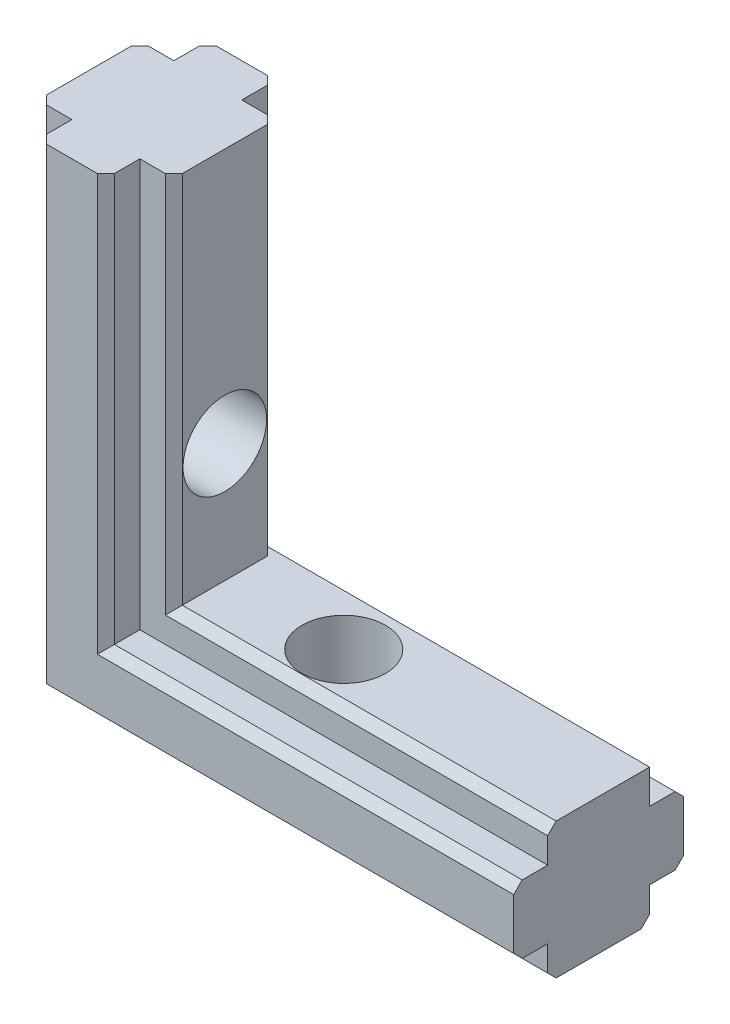
ISO-10303-21;
HEADER;
FILE_DESCRIPTION(('STEP AP214'),'2;1');
FILE_NAME('part.step','',(''),(''),'','','');
FILE_SCHEMA(('AUTOMOTIVE_DESIGN { 1 0 10303 214 1 1 1 1 }'));
ENDSEC;
DATA;
#1=APPLICATION_CONTEXT('core data for automotive mechanical design processes');
#2=APPLICATION_PROTOCOL_DEFINITION('international standard','automotive_design',2000,#1);
#3=PRODUCT_CONTEXT('',#1,'mechanical');
#4=PRODUCT('Part','Part','',(#3));
#5=PRODUCT_RELATED_PRODUCT_CATEGORY('part','',(#4));
#6=PRODUCT_DEFINITION_FORMATION('','',#4);
#7=PRODUCT_DEFINITION_CONTEXT('part definition',#1,'design');
#8=PRODUCT_DEFINITION('design','',#6,#7);
#9=PRODUCT_DEFINITION_SHAPE('','',#8);
#10=(LENGTH_UNIT() NAMED_UNIT(*) SI_UNIT(.MILLI.,.METRE.));
#11=(NAMED_UNIT(*) PLANE_ANGLE_UNIT() SI_UNIT($,.RADIAN.));
#12=(NAMED_UNIT(*) SI_UNIT($,.STERADIAN.) SOLID_ANGLE_UNIT());
#13=UNCERTAINTY_MEASURE_WITH_UNIT(LENGTH_MEASURE(1.E-05),#10,'distance_accuracy_value','');
#14=(GEOMETRIC_REPRESENTATION_CONTEXT(3) GLOBAL_UNCERTAINTY_ASSIGNED_CONTEXT((#13)) GLOBAL_UNIT_ASSIGNED_CONTEXT((#10,
#11,#12)) REPRESENTATION_CONTEXT('',''));
#15=CARTESIAN_POINT('',(0.,0.,0.));
#16=DIRECTION('',(0.,0.,1.));
#17=DIRECTION('',(1.,0.,0.));
#18=AXIS2_PLACEMENT_3D('',#15,#16,#17);
#19=CARTESIAN_POINT('',(30.,2.,0.));
#20=DIRECTION('',(0.,1.,0.));
#21=DIRECTION('',(0.,0.,1.));
#22=AXIS2_PLACEMENT_3D('',#19,#20,#21);
#23=PLANE('',#22);
#24=DIRECTION('',(0.,0.,1.));
#25=VECTOR('',#24,1.);
#26=CARTESIAN_POINT('',(30.,2.,0.));
#27=LINE('',#26,#25);
#28=CARTESIAN_POINT('',(30.,2.,2.));
#29=VERTEX_POINT('',#28);
#30=CARTESIAN_POINT('',(30.,2.,0.5));
#31=VERTEX_POINT('',#30);
#32=EDGE_CURVE('E215',#29,#31,#27,.F.);
#33=ORIENTED_EDGE('',*,*,#32,.F.);
#34=DIRECTION('',(1.,0.,0.));
#35=VECTOR('',#34,1.);
#36=CARTESIAN_POINT('',(1.,2.,2.));
#37=LINE('',#36,#35);
#38=CARTESIAN_POINT('',(2.,2.,2.));
#39=VERTEX_POINT('',#38);
#40=EDGE_CURVE('E209',#29,#39,#37,.F.);
#41=ORIENTED_EDGE('',*,*,#40,.T.);
#42=DIRECTION('',(0.,0.,-1.));
#43=VECTOR('',#42,1.);
#44=CARTESIAN_POINT('',(2.,2.,0.));
#45=LINE('',#44,#43);
#46=CARTESIAN_POINT('',(2.,2.,0.5));
#47=VERTEX_POINT('',#46);
#48=EDGE_CURVE('E222',#39,#47,#45,.T.);
#49=ORIENTED_EDGE('',*,*,#48,.T.);
#50=DIRECTION('',(1.,0.,0.));
#51=VECTOR('',#50,1.);
#52=CARTESIAN_POINT('',(17.,2.,0.5));
#53=LINE('',#52,#51);
#54=EDGE_CURVE('E225',#31,#47,#53,.F.);
#55=ORIENTED_EDGE('',*,*,#54,.F.);
#56=EDGE_LOOP('',(#33,#41,#49,#55));
#57=FACE_BOUND('',#56,.T.);
#58=ADVANCED_FACE('F17',(#57),#23,.F.);
#59=CARTESIAN_POINT('',(2.,2.,0.));
#60=DIRECTION('',(1.,0.,0.));
#61=DIRECTION('',(0.,0.,-1.));
#62=AXIS2_PLACEMENT_3D('',#59,#60,#61);
#63=PLANE('',#62);
#64=ORIENTED_EDGE('',*,*,#48,.F.);
#65=DIRECTION('',(0.,1.,0.));
#66=VECTOR('',#65,1.);
#67=CARTESIAN_POINT('',(2.,16.,2.));
#68=LINE('',#67,#66);
#69=CARTESIAN_POINT('',(2.,30.,2.));
#70=VERTEX_POINT('',#69);
#71=EDGE_CURVE('E234',#39,#70,#68,.T.);
#72=ORIENTED_EDGE('',*,*,#71,.T.);
#73=DIRECTION('',(0.,0.,-1.));
#74=VECTOR('',#73,1.);
#75=CARTESIAN_POINT('',(2.,30.,0.));
#76=LINE('',#75,#74);
#77=CARTESIAN_POINT('',(2.,30.,0.5));
#78=VERTEX_POINT('',#77);
#79=EDGE_CURVE('E228',#78,#70,#76,.F.);
#80=ORIENTED_EDGE('',*,*,#79,.F.);
#81=DIRECTION('',(0.,1.,0.));
#82=VECTOR('',#81,1.);
#83=CARTESIAN_POINT('',(2.,10.5,0.5));
#84=LINE('',#83,#82);
#85=EDGE_CURVE('E376',#47,#78,#84,.T.);
#86=ORIENTED_EDGE('',*,*,#85,.F.);
#87=EDGE_LOOP('',(#64,#72,#80,#86));
#88=FACE_BOUND('',#87,.T.);
#89=ADVANCED_FACE('F987',(#88),#63,.F.);
#90=CARTESIAN_POINT('',(1.,16.,2.));
#91=DIRECTION('',(0.,0.,1.));
#92=DIRECTION('',(1.,0.,0.));
#93=AXIS2_PLACEMENT_3D('',#90,#91,#92);
#94=PLANE('',#93);
#95=DIRECTION('',(1.,0.,0.));
#96=VECTOR('',#95,1.);
#97=CARTESIAN_POINT('',(1.,30.,2.));
#98=LINE('',#97,#96);
#99=CARTESIAN_POINT('',(0.5,30.,2.));
#100=VERTEX_POINT('',#99);
#101=EDGE_CURVE('E240',#70,#100,#98,.F.);
#102=ORIENTED_EDGE('',*,*,#101,.F.);
#103=ORIENTED_EDGE('',*,*,#71,.F.);
#104=ORIENTED_EDGE('',*,*,#40,.F.);
#105=DIRECTION('',(0.,1.,0.));
#106=VECTOR('',#105,1.);
#107=CARTESIAN_POINT('',(30.,16.,2.));
#108=LINE('',#107,#106);
#109=CARTESIAN_POINT('',(30.,0.5,2.));
#110=VERTEX_POINT('',#109);
#111=EDGE_CURVE('E213',#110,#29,#108,.T.);
#112=ORIENTED_EDGE('',*,*,#111,.F.);
#113=DIRECTION('',(1.,0.,0.));
#114=VECTOR('',#113,1.);
#115=CARTESIAN_POINT('',(0.5,0.5,2.));
#116=LINE('',#115,#114);
#117=CARTESIAN_POINT('',(0.5,0.499999999999999,2.));
#118=VERTEX_POINT('',#117);
#119=EDGE_CURVE('E336',#118,#110,#116,.T.);
#120=ORIENTED_EDGE('',*,*,#119,.F.);
#121=DIRECTION('',(0.,1.,0.));
#122=VECTOR('',#121,1.);
#123=CARTESIAN_POINT('',(0.5,23.,2.));
#124=LINE('',#123,#122);
#125=EDGE_CURVE('E412',#100,#118,#124,.F.);
#126=ORIENTED_EDGE('',*,*,#125,.F.);
#127=EDGE_LOOP('',(#102,#103,#104,#112,#120,#126));
#128=FACE_BOUND('',#127,.T.);
#129=ADVANCED_FACE('F232',(#128),#94,.F.);
#130=CARTESIAN_POINT('',(0.25,23.,2.25));
#131=DIRECTION('',(-0.707106781186547,0.,-0.707106781186548));
#132=DIRECTION('',(-0.707106781186548,0.,0.707106781186547));
#133=AXIS2_PLACEMENT_3D('',#130,#131,#132);
#134=PLANE('',#133);
#135=ORIENTED_EDGE('',*,*,#125,.T.);
#136=DIRECTION('',(0.577350269189626,0.577350269189626,-0.577350269189625));
#137=VECTOR('',#136,1.);
#138=CARTESIAN_POINT('',(0.,0.,2.5));
#139=LINE('',#138,#137);
#140=CARTESIAN_POINT('',(0.,0.,2.5));
#141=VERTEX_POINT('',#140);
#142=EDGE_CURVE('E331',#141,#118,#139,.T.);
#143=ORIENTED_EDGE('',*,*,#142,.F.);
#144=DIRECTION('',(0.,1.,0.));
#145=VECTOR('',#144,1.);
#146=CARTESIAN_POINT('',(0.,30.,2.5));
#147=LINE('',#146,#145);
#148=CARTESIAN_POINT('',(0.,30.,2.5));
#149=VERTEX_POINT('',#148);
#150=EDGE_CURVE('E285',#149,#141,#147,.F.);
#151=ORIENTED_EDGE('',*,*,#150,.F.);
#152=DIRECTION('',(-0.707106781186548,0.,0.707106781186547));
#153=VECTOR('',#152,1.);
#154=CARTESIAN_POINT('',(0.25,30.,2.25));
#155=LINE('',#154,#153);
#156=EDGE_CURVE('E416',#149,#100,#155,.F.);
#157=ORIENTED_EDGE('',*,*,#156,.T.);
#158=EDGE_LOOP('',(#135,#143,#151,#157));
#159=FACE_BOUND('',#158,.T.);
#160=ADVANCED_FACE('F427',(#159),#134,.T.);
#161=CARTESIAN_POINT('',(0.25,19.2333333333333,7.75));
#162=DIRECTION('',(-0.707106781186548,0.,0.707106781186548));
#163=DIRECTION('',(0.707106781186548,0.,0.707106781186548));
#164=AXIS2_PLACEMENT_3D('',#161,#162,#163);
#165=PLANE('',#164);
#166=DIRECTION('',(0.,1.,0.));
#167=VECTOR('',#166,1.);
#168=CARTESIAN_POINT('',(0.,30.,7.5));
#169=LINE('',#168,#167);
#170=CARTESIAN_POINT('',(0.,0.,7.5));
#171=VERTEX_POINT('',#170);
#172=CARTESIAN_POINT('',(0.,30.,7.5));
#173=VERTEX_POINT('',#172);
#174=EDGE_CURVE('E275',#171,#173,#169,.T.);
#175=ORIENTED_EDGE('',*,*,#174,.F.);
#176=DIRECTION('',(-0.577350269189625,-0.577350269189626,-0.577350269189626));
#177=VECTOR('',#176,1.);
#178=CARTESIAN_POINT('',(0.499999999999998,0.5,8.));
#179=LINE('',#178,#177);
#180=CARTESIAN_POINT('',(0.499999999999999,0.499999999999997,8.));
#181=VERTEX_POINT('',#180);
#182=EDGE_CURVE('E319',#181,#171,#179,.T.);
#183=ORIENTED_EDGE('',*,*,#182,.F.);
#184=DIRECTION('',(0.,1.,0.));
#185=VECTOR('',#184,1.);
#186=CARTESIAN_POINT('',(0.5,8.46666666666667,8.));
#187=LINE('',#186,#185);
#188=CARTESIAN_POINT('',(0.5,30.,8.));
#189=VERTEX_POINT('',#188);
#190=EDGE_CURVE('E395',#189,#181,#187,.F.);
#191=ORIENTED_EDGE('',*,*,#190,.F.);
#192=DIRECTION('',(0.707106781186548,0.,0.707106781186548));
#193=VECTOR('',#192,1.);
#194=CARTESIAN_POINT('',(0.25,30.,7.75));
#195=LINE('',#194,#193);
#196=EDGE_CURVE('E409',#189,#173,#195,.F.);
#197=ORIENTED_EDGE('',*,*,#196,.T.);
#198=EDGE_LOOP('',(#175,#183,#191,#197));
#199=FACE_BOUND('',#198,.T.);
#200=ADVANCED_FACE('F627',(#199),#165,.T.);
#201=CARTESIAN_POINT('',(7.75,10.4791666666667,7.75));
#202=DIRECTION('',(0.707106781186548,0.,0.707106781186548));
#203=DIRECTION('',(0.707106781186548,0.,-0.707106781186548));
#204=AXIS2_PLACEMENT_3D('',#201,#202,#203);
#205=PLANE('',#204);
#206=DIRECTION('',(0.,1.,0.));
#207=VECTOR('',#206,1.);
#208=CARTESIAN_POINT('',(7.5,12.9583333333333,8.));
#209=LINE('',#208,#207);
#210=CARTESIAN_POINT('',(7.5,7.5,8.));
#211=VERTEX_POINT('',#210);
#212=CARTESIAN_POINT('',(7.5,30.,8.));
#213=VERTEX_POINT('',#212);
#214=EDGE_CURVE('E315',#211,#213,#209,.T.);
#215=ORIENTED_EDGE('',*,*,#214,.F.);
#216=DIRECTION('',(-0.577350269189626,-0.577350269189626,0.577350269189626));
#217=VECTOR('',#216,1.);
#218=CARTESIAN_POINT('',(8.,8.,7.5));
#219=LINE('',#218,#217);
#220=CARTESIAN_POINT('',(8.,8.,7.5));
#221=VERTEX_POINT('',#220);
#222=EDGE_CURVE('E338',#221,#211,#219,.T.);
#223=ORIENTED_EDGE('',*,*,#222,.F.);
#224=DIRECTION('',(0.,1.,0.));
#225=VECTOR('',#224,1.);
#226=CARTESIAN_POINT('',(8.,8.,7.5));
#227=LINE('',#226,#225);
#228=CARTESIAN_POINT('',(8.,30.,7.5));
#229=VERTEX_POINT('',#228);
#230=EDGE_CURVE('E269',#229,#221,#227,.F.);
#231=ORIENTED_EDGE('',*,*,#230,.F.);
#232=DIRECTION('',(0.707106781186548,0.,-0.707106781186548));
#233=VECTOR('',#232,1.);
#234=CARTESIAN_POINT('',(7.75,30.,7.75));
#235=LINE('',#234,#233);
#236=EDGE_CURVE('E406',#229,#213,#235,.F.);
#237=ORIENTED_EDGE('',*,*,#236,.T.);
#238=EDGE_LOOP('',(#215,#223,#231,#237));
#239=FACE_BOUND('',#238,.T.);
#240=ADVANCED_FACE('F953',(#239),#205,.T.);
#241=CARTESIAN_POINT('',(43.5889894354067,15.,5.));
#242=DIRECTION('',(-1.,0.,0.));
#243=DIRECTION('',(0.,0.,1.));
#244=AXIS2_PLACEMENT_3D('',#241,#242,#243);
#245=CYLINDRICAL_SURFACE('',#244,2.4585);
#246=CARTESIAN_POINT('',(0.,15.,5.));
#247=DIRECTION('',(-1.,0.,0.));
#248=DIRECTION('',(0.,0.,1.));
#249=AXIS2_PLACEMENT_3D('',#246,#247,#248);
#250=CIRCLE('',#249,2.4585);
#251=CARTESIAN_POINT('',(0.,15.,7.4585));
#252=VERTEX_POINT('',#251);
#253=EDGE_CURVE('E271',#252,#252,#250,.F.);
#254=ORIENTED_EDGE('',*,*,#253,.F.);
#255=EDGE_LOOP('',(#254));
#256=FACE_BOUND('',#255,.T.);
#257=CARTESIAN_POINT('',(8.,15.,5.));
#258=DIRECTION('',(-1.,0.,0.));
#259=DIRECTION('',(0.,0.,1.));
#260=AXIS2_PLACEMENT_3D('',#257,#258,#259);
#261=CIRCLE('',#260,2.4585);
#262=CARTESIAN_POINT('',(8.,15.,7.4585));
#263=VERTEX_POINT('',#262);
#264=EDGE_CURVE('E264',#263,#263,#261,.T.);
#265=ORIENTED_EDGE('',*,*,#264,.F.);
#266=EDGE_LOOP('',(#265));
#267=FACE_BOUND('',#266,.T.);
#268=ADVANCED_FACE('F944',(#256,#267),#245,.F.);
#269=CARTESIAN_POINT('',(8.46666666666667,8.46666666666667,8.));
#270=DIRECTION('',(0.,0.,1.));
#271=DIRECTION('',(1.,0.,0.));
#272=AXIS2_PLACEMENT_3D('',#269,#270,#271);
#273=PLANE('',#272);
#274=DIRECTION('',(1.,0.,0.));
#275=VECTOR('',#274,1.);
#276=CARTESIAN_POINT('',(8.46666666666667,30.,8.));
#277=LINE('',#276,#275);
#278=CARTESIAN_POINT('',(2.,30.,8.));
#279=VERTEX_POINT('',#278);
#280=EDGE_CURVE('E398',#279,#189,#277,.F.);
#281=ORIENTED_EDGE('',*,*,#280,.T.);
#282=ORIENTED_EDGE('',*,*,#190,.T.);
#283=DIRECTION('',(1.,0.,0.));
#284=VECTOR('',#283,1.);
#285=CARTESIAN_POINT('',(4.23333333333333,0.5,8.));
#286=LINE('',#285,#284);
#287=CARTESIAN_POINT('',(30.,0.5,8.));
#288=VERTEX_POINT('',#287);
#289=EDGE_CURVE('E323',#288,#181,#286,.F.);
#290=ORIENTED_EDGE('',*,*,#289,.F.);
#291=DIRECTION('',(0.,1.,0.));
#292=VECTOR('',#291,1.);
#293=CARTESIAN_POINT('',(30.,8.46666666666667,8.));
#294=LINE('',#293,#292);
#295=CARTESIAN_POINT('',(30.,2.,8.));
#296=VERTEX_POINT('',#295);
#297=EDGE_CURVE('E402',#288,#296,#294,.T.);
#298=ORIENTED_EDGE('',*,*,#297,.T.);
#299=DIRECTION('',(1.,0.,0.));
#300=VECTOR('',#299,1.);
#301=CARTESIAN_POINT('',(2.,2.,8.));
#302=LINE('',#301,#300);
#303=CARTESIAN_POINT('',(2.,2.,8.));
#304=VERTEX_POINT('',#303);
#305=EDGE_CURVE('E500',#296,#304,#302,.F.);
#306=ORIENTED_EDGE('',*,*,#305,.T.);
#307=DIRECTION('',(0.,1.,0.));
#308=VECTOR('',#307,1.);
#309=CARTESIAN_POINT('',(2.,30.,8.));
#310=LINE('',#309,#308);
#311=EDGE_CURVE('E268',#304,#279,#310,.T.);
#312=ORIENTED_EDGE('',*,*,#311,.T.);
#313=EDGE_LOOP('',(#281,#282,#290,#298,#306,#312));
#314=FACE_BOUND('',#313,.T.);
#315=ADVANCED_FACE('F616',(#314),#273,.T.);
#316=CARTESIAN_POINT('',(17.,2.25,0.25));
#317=DIRECTION('',(0.,-0.707106781186548,-0.707106781186547));
#318=DIRECTION('',(0.,0.707106781186547,-0.707106781186548));
#319=AXIS2_PLACEMENT_3D('',#316,#317,#318);
#320=PLANE('',#319);
#321=ORIENTED_EDGE('',*,*,#54,.T.);
#322=DIRECTION('',(-0.577350269189625,-0.577350269189626,0.577350269189626));
#323=VECTOR('',#322,1.);
#324=CARTESIAN_POINT('',(2.5,2.5,0.));
#325=LINE('',#324,#323);
#326=CARTESIAN_POINT('',(2.5,2.5,0.));
#327=VERTEX_POINT('',#326);
#328=EDGE_CURVE('E369',#327,#47,#325,.T.);
#329=ORIENTED_EDGE('',*,*,#328,.F.);
#330=DIRECTION('',(1.,0.,0.));
#331=VECTOR('',#330,1.);
#332=CARTESIAN_POINT('',(4.,2.5,0.));
#333=LINE('',#332,#331);
#334=CARTESIAN_POINT('',(30.,2.5,0.));
#335=VERTEX_POINT('',#334);
#336=EDGE_CURVE('E493',#327,#335,#333,.T.);
#337=ORIENTED_EDGE('',*,*,#336,.T.);
#338=DIRECTION('',(0.,0.707106781186547,-0.707106781186548));
#339=VECTOR('',#338,1.);
#340=CARTESIAN_POINT('',(30.,2.25,0.25));
#341=LINE('',#340,#339);
#342=EDGE_CURVE('E392',#335,#31,#341,.F.);
#343=ORIENTED_EDGE('',*,*,#342,.T.);
#344=EDGE_LOOP('',(#321,#329,#337,#343));
#345=FACE_BOUND('',#344,.T.);
#346=ADVANCED_FACE('F925',(#345),#320,.T.);
#347=CARTESIAN_POINT('',(6.,5.75,0.25));
#348=DIRECTION('',(0.,0.707106781186547,-0.707106781186548));
#349=DIRECTION('',(0.,0.707106781186548,0.707106781186547));
#350=AXIS2_PLACEMENT_3D('',#347,#348,#349);
#351=PLANE('',#350);
#352=DIRECTION('',(1.,0.,0.));
#353=VECTOR('',#352,1.);
#354=CARTESIAN_POINT('',(4.,5.5,0.));
#355=LINE('',#354,#353);
#356=CARTESIAN_POINT('',(30.,5.5,0.));
#357=VERTEX_POINT('',#356);
#358=CARTESIAN_POINT('',(5.5,5.5,0.));
#359=VERTEX_POINT('',#358);
#360=EDGE_CURVE('E490',#357,#359,#355,.F.);
#361=ORIENTED_EDGE('',*,*,#360,.T.);
#362=DIRECTION('',(-0.577350269189626,-0.577350269189626,-0.577350269189625));
#363=VECTOR('',#362,1.);
#364=CARTESIAN_POINT('',(6.,6.,0.5));
#365=LINE('',#364,#363);
#366=CARTESIAN_POINT('',(6.,5.99999999999999,0.499999999999999));
#367=VERTEX_POINT('',#366);
#368=EDGE_CURVE('E380',#367,#359,#365,.T.);
#369=ORIENTED_EDGE('',*,*,#368,.F.);
#370=DIRECTION('',(1.,0.,0.));
#371=VECTOR('',#370,1.);
#372=CARTESIAN_POINT('',(8.,6.,0.5));
#373=LINE('',#372,#371);
#374=CARTESIAN_POINT('',(30.,6.,0.5));
#375=VERTEX_POINT('',#374);
#376=EDGE_CURVE('E351',#367,#375,#373,.T.);
#377=ORIENTED_EDGE('',*,*,#376,.T.);
#378=DIRECTION('',(0.,0.707106781186548,0.707106781186547));
#379=VECTOR('',#378,1.);
#380=CARTESIAN_POINT('',(30.,5.75,0.25));
#381=LINE('',#380,#379);
#382=EDGE_CURVE('E388',#375,#357,#381,.F.);
#383=ORIENTED_EDGE('',*,*,#382,.T.);
#384=EDGE_LOOP('',(#361,#369,#377,#383));
#385=FACE_BOUND('',#384,.T.);
#386=ADVANCED_FACE('F915',(#385),#351,.T.);
#387=CARTESIAN_POINT('',(5.75,24.5,0.25));
#388=DIRECTION('',(0.707106781186547,0.,-0.707106781186548));
#389=DIRECTION('',(-0.707106781186548,0.,-0.707106781186547));
#390=AXIS2_PLACEMENT_3D('',#387,#388,#389);
#391=PLANE('',#390);
#392=DIRECTION('',(0.,1.,0.));
#393=VECTOR('',#392,1.);
#394=CARTESIAN_POINT('',(6.,30.,0.5));
#395=LINE('',#394,#393);
#396=CARTESIAN_POINT('',(6.,30.,0.5));
#397=VERTEX_POINT('',#396);
#398=EDGE_CURVE('E362',#397,#367,#395,.F.);
#399=ORIENTED_EDGE('',*,*,#398,.T.);
#400=ORIENTED_EDGE('',*,*,#368,.T.);
#401=DIRECTION('',(0.,1.,0.));
#402=VECTOR('',#401,1.);
#403=CARTESIAN_POINT('',(5.5,19.,0.));
#404=LINE('',#403,#402);
#405=CARTESIAN_POINT('',(5.5,30.,0.));
#406=VERTEX_POINT('',#405);
#407=EDGE_CURVE('E486',#359,#406,#404,.T.);
#408=ORIENTED_EDGE('',*,*,#407,.T.);
#409=DIRECTION('',(-0.707106781186548,0.,-0.707106781186547));
#410=VECTOR('',#409,1.);
#411=CARTESIAN_POINT('',(5.75,30.,0.25));
#412=LINE('',#411,#410);
#413=EDGE_CURVE('E384',#406,#397,#412,.F.);
#414=ORIENTED_EDGE('',*,*,#413,.T.);
#415=EDGE_LOOP('',(#399,#400,#408,#414));
#416=FACE_BOUND('',#415,.T.);
#417=ADVANCED_FACE('F905',(#416),#391,.T.);
#418=CARTESIAN_POINT('',(2.25,10.5,0.25));
#419=DIRECTION('',(-0.707106781186548,0.,-0.707106781186547));
#420=DIRECTION('',(-0.707106781186547,0.,0.707106781186548));
#421=AXIS2_PLACEMENT_3D('',#418,#419,#420);
#422=PLANE('',#421);
#423=DIRECTION('',(0.,1.,0.));
#424=VECTOR('',#423,1.);
#425=CARTESIAN_POINT('',(2.5,19.,0.));
#426=LINE('',#425,#424);
#427=CARTESIAN_POINT('',(2.5,30.,0.));
#428=VERTEX_POINT('',#427);
#429=EDGE_CURVE('E482',#428,#327,#426,.F.);
#430=ORIENTED_EDGE('',*,*,#429,.T.);
#431=ORIENTED_EDGE('',*,*,#328,.T.);
#432=ORIENTED_EDGE('',*,*,#85,.T.);
#433=DIRECTION('',(-0.707106781186547,0.,0.707106781186548));
#434=VECTOR('',#433,1.);
#435=CARTESIAN_POINT('',(2.25,30.,0.25));
#436=LINE('',#435,#434);
#437=EDGE_CURVE('E373',#78,#428,#436,.F.);
#438=ORIENTED_EDGE('',*,*,#437,.T.);
#439=EDGE_LOOP('',(#430,#431,#432,#438));
#440=FACE_BOUND('',#439,.T.);
#441=ADVANCED_FACE('F895',(#440),#422,.T.);
#442=CARTESIAN_POINT('',(6.,30.,0.));
#443=DIRECTION('',(-1.,0.,0.));
#444=DIRECTION('',(0.,0.,1.));
#445=AXIS2_PLACEMENT_3D('',#442,#443,#444);
#446=PLANE('',#445);
#447=DIRECTION('',(0.,0.,1.));
#448=VECTOR('',#447,1.);
#449=CARTESIAN_POINT('',(6.,30.,0.));
#450=LINE('',#449,#448);
#451=CARTESIAN_POINT('',(6.,30.,2.));
#452=VERTEX_POINT('',#451);
#453=EDGE_CURVE('E366',#452,#397,#450,.F.);
#454=ORIENTED_EDGE('',*,*,#453,.F.);
#455=DIRECTION('',(0.,1.,0.));
#456=VECTOR('',#455,1.);
#457=CARTESIAN_POINT('',(6.,7.,2.));
#458=LINE('',#457,#456);
#459=CARTESIAN_POINT('',(6.,6.,2.));
#460=VERTEX_POINT('',#459);
#461=EDGE_CURVE('E479',#452,#460,#458,.F.);
#462=ORIENTED_EDGE('',*,*,#461,.T.);
#463=DIRECTION('',(0.,0.,-1.));
#464=VECTOR('',#463,1.);
#465=CARTESIAN_POINT('',(6.,6.,0.));
#466=LINE('',#465,#464);
#467=EDGE_CURVE('E355',#460,#367,#466,.T.);
#468=ORIENTED_EDGE('',*,*,#467,.T.);
#469=ORIENTED_EDGE('',*,*,#398,.F.);
#470=EDGE_LOOP('',(#454,#462,#468,#469));
#471=FACE_BOUND('',#470,.T.);
#472=ADVANCED_FACE('F885',(#471),#446,.F.);
#473=CARTESIAN_POINT('',(8.,6.,0.));
#474=DIRECTION('',(0.,-1.,0.));
#475=DIRECTION('',(0.,0.,-1.));
#476=AXIS2_PLACEMENT_3D('',#473,#474,#475);
#477=PLANE('',#476);
#478=ORIENTED_EDGE('',*,*,#467,.F.);
#479=DIRECTION('',(1.,0.,0.));
#480=VECTOR('',#479,1.);
#481=CARTESIAN_POINT('',(19.,6.,2.));
#482=LINE('',#481,#480);
#483=CARTESIAN_POINT('',(30.,6.,2.));
#484=VERTEX_POINT('',#483);
#485=EDGE_CURVE('E475',#460,#484,#482,.T.);
#486=ORIENTED_EDGE('',*,*,#485,.T.);
#487=DIRECTION('',(0.,0.,-1.));
#488=VECTOR('',#487,1.);
#489=CARTESIAN_POINT('',(30.,6.,0.));
#490=LINE('',#489,#488);
#491=EDGE_CURVE('E359',#375,#484,#490,.F.);
#492=ORIENTED_EDGE('',*,*,#491,.F.);
#493=ORIENTED_EDGE('',*,*,#376,.F.);
#494=EDGE_LOOP('',(#478,#486,#492,#493));
#495=FACE_BOUND('',#494,.T.);
#496=ADVANCED_FACE('F876',(#495),#477,.F.);
#497=CARTESIAN_POINT('',(7.75,7.5,2.25));
#498=DIRECTION('',(0.707106781186547,0.,-0.707106781186548));
#499=DIRECTION('',(-0.707106781186548,0.,-0.707106781186547));
#500=AXIS2_PLACEMENT_3D('',#497,#498,#499);
#501=PLANE('',#500);
#502=DIRECTION('',(-0.707106781186548,0.,-0.707106781186547));
#503=VECTOR('',#502,1.);
#504=CARTESIAN_POINT('',(7.75,8.,2.25));
#505=LINE('',#504,#503);
#506=CARTESIAN_POINT('',(8.,8.,2.5));
#507=VERTEX_POINT('',#506);
#508=CARTESIAN_POINT('',(7.5,8.,2.));
#509=VERTEX_POINT('',#508);
#510=EDGE_CURVE('E345',#507,#509,#505,.T.);
#511=ORIENTED_EDGE('',*,*,#510,.T.);
#512=DIRECTION('',(0.,1.,0.));
#513=VECTOR('',#512,1.);
#514=CARTESIAN_POINT('',(7.5,7.,2.));
#515=LINE('',#514,#513);
#516=CARTESIAN_POINT('',(7.5,30.,2.));
#517=VERTEX_POINT('',#516);
#518=EDGE_CURVE('E471',#509,#517,#515,.T.);
#519=ORIENTED_EDGE('',*,*,#518,.T.);
#520=DIRECTION('',(-0.707106781186548,0.,-0.707106781186547));
#521=VECTOR('',#520,1.);
#522=CARTESIAN_POINT('',(7.75,30.,2.25));
#523=LINE('',#522,#521);
#524=CARTESIAN_POINT('',(8.,30.,2.5));
#525=VERTEX_POINT('',#524);
#526=EDGE_CURVE('E348',#517,#525,#523,.F.);
#527=ORIENTED_EDGE('',*,*,#526,.T.);
#528=DIRECTION('',(0.,1.,0.));
#529=VECTOR('',#528,1.);
#530=CARTESIAN_POINT('',(8.,8.,2.5));
#531=LINE('',#530,#529);
#532=EDGE_CURVE('E274',#507,#525,#531,.T.);
#533=ORIENTED_EDGE('',*,*,#532,.F.);
#534=EDGE_LOOP('',(#511,#519,#527,#533));
#535=FACE_BOUND('',#534,.T.);
#536=ADVANCED_FACE('F526',(#535),#501,.T.);
#537=CARTESIAN_POINT('',(21.4791666666667,7.75,7.75));
#538=DIRECTION('',(0.,0.707106781186548,0.707106781186547));
#539=DIRECTION('',(0.,-0.707106781186547,0.707106781186548));
#540=AXIS2_PLACEMENT_3D('',#537,#538,#539);
#541=PLANE('',#540);
#542=DIRECTION('',(1.,0.,0.));
#543=VECTOR('',#542,1.);
#544=CARTESIAN_POINT('',(30.,8.,7.5));
#545=LINE('',#544,#543);
#546=CARTESIAN_POINT('',(30.,8.,7.5));
#547=VERTEX_POINT('',#546);
#548=EDGE_CURVE('E467',#221,#547,#545,.T.);
#549=ORIENTED_EDGE('',*,*,#548,.F.);
#550=ORIENTED_EDGE('',*,*,#222,.T.);
#551=DIRECTION('',(1.,0.,0.));
#552=VECTOR('',#551,1.);
#553=CARTESIAN_POINT('',(12.9583333333333,7.5,8.));
#554=LINE('',#553,#552);
#555=CARTESIAN_POINT('',(30.,7.5,8.));
#556=VERTEX_POINT('',#555);
#557=EDGE_CURVE('E303',#556,#211,#554,.F.);
#558=ORIENTED_EDGE('',*,*,#557,.F.);
#559=DIRECTION('',(0.,-0.707106781186547,0.707106781186548));
#560=VECTOR('',#559,1.);
#561=CARTESIAN_POINT('',(30.,7.75,7.75));
#562=LINE('',#561,#560);
#563=EDGE_CURVE('E342',#556,#547,#562,.F.);
#564=ORIENTED_EDGE('',*,*,#563,.T.);
#565=EDGE_LOOP('',(#549,#550,#558,#564));
#566=FACE_BOUND('',#565,.T.);
#567=ADVANCED_FACE('F637',(#566),#541,.T.);
#568=CARTESIAN_POINT('',(0.5,0.25,2.25));
#569=DIRECTION('',(0.,-0.707106781186547,-0.707106781186548));
#570=DIRECTION('',(0.,0.707106781186548,-0.707106781186547));
#571=AXIS2_PLACEMENT_3D('',#568,#569,#570);
#572=PLANE('',#571);
#573=DIRECTION('',(1.,0.,0.));
#574=VECTOR('',#573,1.);
#575=CARTESIAN_POINT('',(0.,0.,2.5));
#576=LINE('',#575,#574);
#577=CARTESIAN_POINT('',(30.,0.,2.5));
#578=VERTEX_POINT('',#577);
#579=EDGE_CURVE('E260',#141,#578,#576,.T.);
#580=ORIENTED_EDGE('',*,*,#579,.F.);
#581=ORIENTED_EDGE('',*,*,#142,.T.);
#582=ORIENTED_EDGE('',*,*,#119,.T.);
#583=DIRECTION('',(0.,0.707106781186548,-0.707106781186547));
#584=VECTOR('',#583,1.);
#585=CARTESIAN_POINT('',(30.,0.25,2.25));
#586=LINE('',#585,#584);
#587=EDGE_CURVE('E218',#110,#578,#586,.F.);
#588=ORIENTED_EDGE('',*,*,#587,.T.);
#589=EDGE_LOOP('',(#580,#581,#582,#588));
#590=FACE_BOUND('',#589,.T.);
#591=ADVANCED_FACE('F635',(#590),#572,.T.);
#592=CARTESIAN_POINT('',(4.23333333333333,0.25,7.75));
#593=DIRECTION('',(0.,-0.707106781186548,0.707106781186548));
#594=DIRECTION('',(0.,-0.707106781186548,-0.707106781186548));
#595=AXIS2_PLACEMENT_3D('',#592,#593,#594);
#596=PLANE('',#595);
#597=ORIENTED_EDGE('',*,*,#289,.T.);
#598=ORIENTED_EDGE('',*,*,#182,.T.);
#599=DIRECTION('',(1.,0.,0.));
#600=VECTOR('',#599,1.);
#601=CARTESIAN_POINT('',(0.,0.,7.5));
#602=LINE('',#601,#600);
#603=CARTESIAN_POINT('',(30.,0.,7.5));
#604=VERTEX_POINT('',#603);
#605=EDGE_CURVE('E454',#604,#171,#602,.F.);
#606=ORIENTED_EDGE('',*,*,#605,.F.);
#607=DIRECTION('',(0.,-0.707106781186548,-0.707106781186548));
#608=VECTOR('',#607,1.);
#609=CARTESIAN_POINT('',(30.,0.25,7.75));
#610=LINE('',#609,#608);
#611=EDGE_CURVE('E327',#604,#288,#610,.F.);
#612=ORIENTED_EDGE('',*,*,#611,.T.);
#613=EDGE_LOOP('',(#597,#598,#606,#612));
#614=FACE_BOUND('',#613,.T.);
#615=ADVANCED_FACE('F630',(#614),#596,.T.);
#616=CARTESIAN_POINT('',(15.,43.5889894354067,5.));
#617=DIRECTION('',(0.,-1.,0.));
#618=DIRECTION('',(0.,0.,-1.));
#619=AXIS2_PLACEMENT_3D('',#616,#617,#618);
#620=CYLINDRICAL_SURFACE('',#619,2.4585);
#621=CARTESIAN_POINT('',(15.,0.,5.));
#622=DIRECTION('',(0.,-1.,0.));
#623=DIRECTION('',(0.,0.,-1.));
#624=AXIS2_PLACEMENT_3D('',#621,#622,#623);
#625=CIRCLE('',#624,2.4585);
#626=CARTESIAN_POINT('',(15.,0.,2.5415));
#627=VERTEX_POINT('',#626);
#628=EDGE_CURVE('E248',#627,#627,#625,.F.);
#629=ORIENTED_EDGE('',*,*,#628,.F.);
#630=EDGE_LOOP('',(#629));
#631=FACE_BOUND('',#630,.T.);
#632=CARTESIAN_POINT('',(15.,8.,5.));
#633=DIRECTION('',(0.,-1.,0.));
#634=DIRECTION('',(0.,0.,-1.));
#635=AXIS2_PLACEMENT_3D('',#632,#633,#634);
#636=CIRCLE('',#635,2.4585);
#637=CARTESIAN_POINT('',(15.,8.,2.5415));
#638=VERTEX_POINT('',#637);
#639=EDGE_CURVE('E256',#638,#638,#636,.T.);
#640=ORIENTED_EDGE('',*,*,#639,.F.);
#641=EDGE_LOOP('',(#640));
#642=FACE_BOUND('',#641,.T.);
#643=ADVANCED_FACE('F644',(#631,#642),#620,.F.);
#644=CARTESIAN_POINT('',(12.9583333333333,12.9583333333333,8.));
#645=DIRECTION('',(0.,0.,1.));
#646=DIRECTION('',(1.,0.,0.));
#647=AXIS2_PLACEMENT_3D('',#644,#645,#646);
#648=PLANE('',#647);
#649=DIRECTION('',(0.,1.,0.));
#650=VECTOR('',#649,1.);
#651=CARTESIAN_POINT('',(30.,12.9583333333333,8.));
#652=LINE('',#651,#650);
#653=CARTESIAN_POINT('',(30.,6.,8.));
#654=VERTEX_POINT('',#653);
#655=EDGE_CURVE('E307',#654,#556,#652,.T.);
#656=ORIENTED_EDGE('',*,*,#655,.T.);
#657=ORIENTED_EDGE('',*,*,#557,.T.);
#658=ORIENTED_EDGE('',*,*,#214,.T.);
#659=DIRECTION('',(1.,0.,0.));
#660=VECTOR('',#659,1.);
#661=CARTESIAN_POINT('',(12.9583333333333,30.,8.));
#662=LINE('',#661,#660);
#663=CARTESIAN_POINT('',(6.,30.,8.));
#664=VERTEX_POINT('',#663);
#665=EDGE_CURVE('E311',#213,#664,#662,.F.);
#666=ORIENTED_EDGE('',*,*,#665,.T.);
#667=DIRECTION('',(0.,1.,0.));
#668=VECTOR('',#667,1.);
#669=CARTESIAN_POINT('',(6.,6.,8.));
#670=LINE('',#669,#668);
#671=CARTESIAN_POINT('',(6.,6.,8.));
#672=VERTEX_POINT('',#671);
#673=EDGE_CURVE('E294',#664,#672,#670,.F.);
#674=ORIENTED_EDGE('',*,*,#673,.T.);
#675=DIRECTION('',(1.,0.,0.));
#676=VECTOR('',#675,1.);
#677=CARTESIAN_POINT('',(30.,6.,8.));
#678=LINE('',#677,#676);
#679=EDGE_CURVE('E443',#672,#654,#678,.T.);
#680=ORIENTED_EDGE('',*,*,#679,.T.);
#681=EDGE_LOOP('',(#656,#657,#658,#666,#674,#680));
#682=FACE_BOUND('',#681,.T.);
#683=ADVANCED_FACE('F701',(#682),#648,.T.);
#684=CARTESIAN_POINT('',(6.,6.,10.));
#685=DIRECTION('',(-1.,0.,0.));
#686=DIRECTION('',(0.,0.,1.));
#687=AXIS2_PLACEMENT_3D('',#684,#685,#686);
#688=PLANE('',#687);
#689=DIRECTION('',(0.,0.,-1.));
#690=VECTOR('',#689,1.);
#691=CARTESIAN_POINT('',(6.,6.,10.));
#692=LINE('',#691,#690);
#693=CARTESIAN_POINT('',(6.,6.,9.5));
#694=VERTEX_POINT('',#693);
#695=EDGE_CURVE('E252',#694,#672,#692,.T.);
#696=ORIENTED_EDGE('',*,*,#695,.T.);
#697=ORIENTED_EDGE('',*,*,#673,.F.);
#698=DIRECTION('',(0.,0.,1.));
#699=VECTOR('',#698,1.);
#700=CARTESIAN_POINT('',(6.,30.,10.));
#701=LINE('',#700,#699);
#702=CARTESIAN_POINT('',(6.,30.,9.5));
#703=VERTEX_POINT('',#702);
#704=EDGE_CURVE('E300',#703,#664,#701,.F.);
#705=ORIENTED_EDGE('',*,*,#704,.F.);
#706=DIRECTION('',(0.,1.,0.));
#707=VECTOR('',#706,1.);
#708=CARTESIAN_POINT('',(6.,12.5,9.5));
#709=LINE('',#708,#707);
#710=EDGE_CURVE('E434',#694,#703,#709,.T.);
#711=ORIENTED_EDGE('',*,*,#710,.F.);
#712=EDGE_LOOP('',(#696,#697,#705,#711));
#713=FACE_BOUND('',#712,.T.);
#714=ADVANCED_FACE('F698',(#713),#688,.F.);
#715=CARTESIAN_POINT('',(0.,30.,0.));
#716=DIRECTION('',(-1.,0.,0.));
#717=DIRECTION('',(0.,0.,1.));
#718=AXIS2_PLACEMENT_3D('',#715,#716,#717);
#719=PLANE('',#718);
#720=ORIENTED_EDGE('',*,*,#253,.T.);
#721=EDGE_LOOP('',(#720));
#722=FACE_BOUND('',#721,.T.);
#723=ORIENTED_EDGE('',*,*,#174,.T.);
#724=DIRECTION('',(0.,0.,1.));
#725=VECTOR('',#724,1.);
#726=CARTESIAN_POINT('',(0.,30.,0.));
#727=LINE('',#726,#725);
#728=EDGE_CURVE('E430',#149,#173,#727,.T.);
#729=ORIENTED_EDGE('',*,*,#728,.F.);
#730=ORIENTED_EDGE('',*,*,#150,.T.);
#731=DIRECTION('',(0.,0.,-1.));
#732=VECTOR('',#731,1.);
#733=CARTESIAN_POINT('',(0.,0.,0.));
#734=LINE('',#733,#732);
#735=EDGE_CURVE('E253',#171,#141,#734,.T.);
#736=ORIENTED_EDGE('',*,*,#735,.F.);
#737=EDGE_LOOP('',(#723,#729,#730,#736));
#738=FACE_BOUND('',#737,.T.);
#739=ADVANCED_FACE('F431',(#722,#738),#719,.T.);
#740=CARTESIAN_POINT('',(8.,8.,0.));
#741=DIRECTION('',(1.,0.,0.));
#742=DIRECTION('',(0.,0.,-1.));
#743=AXIS2_PLACEMENT_3D('',#740,#741,#742);
#744=PLANE('',#743);
#745=ORIENTED_EDGE('',*,*,#264,.T.);
#746=EDGE_LOOP('',(#745));
#747=FACE_BOUND('',#746,.T.);
#748=ORIENTED_EDGE('',*,*,#230,.T.);
#749=DIRECTION('',(0.,0.,1.));
#750=VECTOR('',#749,1.);
#751=CARTESIAN_POINT('',(8.,8.,0.));
#752=LINE('',#751,#750);
#753=EDGE_CURVE('E261',#507,#221,#752,.T.);
#754=ORIENTED_EDGE('',*,*,#753,.F.);
#755=ORIENTED_EDGE('',*,*,#532,.T.);
#756=DIRECTION('',(0.,0.,1.));
#757=VECTOR('',#756,1.);
#758=CARTESIAN_POINT('',(8.,30.,0.));
#759=LINE('',#758,#757);
#760=EDGE_CURVE('E516',#229,#525,#759,.F.);
#761=ORIENTED_EDGE('',*,*,#760,.F.);
#762=EDGE_LOOP('',(#748,#754,#755,#761));
#763=FACE_BOUND('',#762,.T.);
#764=ADVANCED_FACE('F514',(#747,#763),#744,.T.);
#765=CARTESIAN_POINT('',(2.,30.,10.));
#766=DIRECTION('',(1.,0.,0.));
#767=DIRECTION('',(0.,0.,-1.));
#768=AXIS2_PLACEMENT_3D('',#765,#766,#767);
#769=PLANE('',#768);
#770=DIRECTION('',(0.,0.,1.));
#771=VECTOR('',#770,1.);
#772=CARTESIAN_POINT('',(2.,30.,0.));
#773=LINE('',#772,#771);
#774=CARTESIAN_POINT('',(2.,30.,9.5));
#775=VERTEX_POINT('',#774);
#776=EDGE_CURVE('E433',#279,#775,#773,.T.);
#777=ORIENTED_EDGE('',*,*,#776,.F.);
#778=ORIENTED_EDGE('',*,*,#311,.F.);
#779=DIRECTION('',(0.,0.,1.));
#780=VECTOR('',#779,1.);
#781=CARTESIAN_POINT('',(2.,2.,10.));
#782=LINE('',#781,#780);
#783=CARTESIAN_POINT('',(2.,2.,9.5));
#784=VERTEX_POINT('',#783);
#785=EDGE_CURVE('E497',#304,#784,#782,.T.);
#786=ORIENTED_EDGE('',*,*,#785,.T.);
#787=DIRECTION('',(0.,1.,0.));
#788=VECTOR('',#787,1.);
#789=CARTESIAN_POINT('',(2.,24.5,9.5));
#790=LINE('',#789,#788);
#791=EDGE_CURVE('E546',#775,#784,#790,.F.);
#792=ORIENTED_EDGE('',*,*,#791,.F.);
#793=EDGE_LOOP('',(#777,#778,#786,#792));
#794=FACE_BOUND('',#793,.T.);
#795=ADVANCED_FACE('F620',(#794),#769,.F.);
#796=CARTESIAN_POINT('',(2.,2.,10.));
#797=DIRECTION('',(0.,1.,0.));
#798=DIRECTION('',(0.,0.,1.));
#799=AXIS2_PLACEMENT_3D('',#796,#797,#798);
#800=PLANE('',#799);
#801=ORIENTED_EDGE('',*,*,#785,.F.);
#802=ORIENTED_EDGE('',*,*,#305,.F.);
#803=DIRECTION('',(0.,0.,1.));
#804=VECTOR('',#803,1.);
#805=CARTESIAN_POINT('',(30.,2.,10.));
#806=LINE('',#805,#804);
#807=CARTESIAN_POINT('',(30.,2.,9.5));
#808=VERTEX_POINT('',#807);
#809=EDGE_CURVE('E503',#808,#296,#806,.F.);
#810=ORIENTED_EDGE('',*,*,#809,.F.);
#811=DIRECTION('',(1.,0.,0.));
#812=VECTOR('',#811,1.);
#813=CARTESIAN_POINT('',(3.,2.,9.5));
#814=LINE('',#813,#812);
#815=EDGE_CURVE('E554',#784,#808,#814,.T.);
#816=ORIENTED_EDGE('',*,*,#815,.F.);
#817=EDGE_LOOP('',(#801,#802,#810,#816));
#818=FACE_BOUND('',#817,.T.);
#819=ADVANCED_FACE('F612',(#818),#800,.F.);
#820=CARTESIAN_POINT('',(4.,19.,0.));
#821=DIRECTION('',(0.,0.,1.));
#822=DIRECTION('',(1.,0.,0.));
#823=AXIS2_PLACEMENT_3D('',#820,#821,#822);
#824=PLANE('',#823);
#825=DIRECTION('',(1.,0.,0.));
#826=VECTOR('',#825,1.);
#827=CARTESIAN_POINT('',(8.,30.,0.));
#828=LINE('',#827,#826);
#829=EDGE_CURVE('E534',#406,#428,#828,.F.);
#830=ORIENTED_EDGE('',*,*,#829,.F.);
#831=ORIENTED_EDGE('',*,*,#407,.F.);
#832=ORIENTED_EDGE('',*,*,#360,.F.);
#833=DIRECTION('',(0.,1.,0.));
#834=VECTOR('',#833,1.);
#835=CARTESIAN_POINT('',(30.,0.,0.));
#836=LINE('',#835,#834);
#837=EDGE_CURVE('E558',#335,#357,#836,.T.);
#838=ORIENTED_EDGE('',*,*,#837,.F.);
#839=ORIENTED_EDGE('',*,*,#336,.F.);
#840=ORIENTED_EDGE('',*,*,#429,.F.);
#841=EDGE_LOOP('',(#830,#831,#832,#838,#839,#840));
#842=FACE_BOUND('',#841,.T.);
#843=ADVANCED_FACE('F684',(#842),#824,.F.);
#844=CARTESIAN_POINT('',(19.,7.,2.));
#845=DIRECTION('',(0.,0.,1.));
#846=DIRECTION('',(1.,0.,0.));
#847=AXIS2_PLACEMENT_3D('',#844,#845,#846);
#848=PLANE('',#847);
#849=DIRECTION('',(1.,0.,0.));
#850=VECTOR('',#849,1.);
#851=CARTESIAN_POINT('',(30.,8.,2.));
#852=LINE('',#851,#850);
#853=CARTESIAN_POINT('',(30.,8.,2.));
#854=VERTEX_POINT('',#853);
#855=EDGE_CURVE('E463',#854,#509,#852,.F.);
#856=ORIENTED_EDGE('',*,*,#855,.F.);
#857=DIRECTION('',(0.,1.,0.));
#858=VECTOR('',#857,1.);
#859=CARTESIAN_POINT('',(30.,0.,2.));
#860=LINE('',#859,#858);
#861=EDGE_CURVE('E562',#484,#854,#860,.T.);
#862=ORIENTED_EDGE('',*,*,#861,.F.);
#863=ORIENTED_EDGE('',*,*,#485,.F.);
#864=ORIENTED_EDGE('',*,*,#461,.F.);
#865=DIRECTION('',(1.,0.,0.));
#866=VECTOR('',#865,1.);
#867=CARTESIAN_POINT('',(8.,30.,2.));
#868=LINE('',#867,#866);
#869=EDGE_CURVE('E530',#517,#452,#868,.F.);
#870=ORIENTED_EDGE('',*,*,#869,.F.);
#871=ORIENTED_EDGE('',*,*,#518,.F.);
#872=EDGE_LOOP('',(#856,#862,#863,#864,#870,#871));
#873=FACE_BOUND('',#872,.T.);
#874=ADVANCED_FACE('F680',(#873),#848,.F.);
#875=CARTESIAN_POINT('',(30.,8.,0.));
#876=DIRECTION('',(0.,1.,0.));
#877=DIRECTION('',(0.,0.,1.));
#878=AXIS2_PLACEMENT_3D('',#875,#876,#877);
#879=PLANE('',#878);
#880=ORIENTED_EDGE('',*,*,#639,.T.);
#881=EDGE_LOOP('',(#880));
#882=FACE_BOUND('',#881,.T.);
#883=ORIENTED_EDGE('',*,*,#510,.F.);
#884=ORIENTED_EDGE('',*,*,#753,.T.);
#885=ORIENTED_EDGE('',*,*,#548,.T.);
#886=DIRECTION('',(0.,0.,-1.));
#887=VECTOR('',#886,1.);
#888=CARTESIAN_POINT('',(30.,8.,0.));
#889=LINE('',#888,#887);
#890=EDGE_CURVE('E566',#854,#547,#889,.F.);
#891=ORIENTED_EDGE('',*,*,#890,.F.);
#892=ORIENTED_EDGE('',*,*,#855,.T.);
#893=EDGE_LOOP('',(#883,#884,#885,#891,#892));
#894=FACE_BOUND('',#893,.T.);
#895=ADVANCED_FACE('F519',(#882,#894),#879,.T.);
#896=CARTESIAN_POINT('',(0.,0.,0.));
#897=DIRECTION('',(0.,-1.,0.));
#898=DIRECTION('',(0.,0.,-1.));
#899=AXIS2_PLACEMENT_3D('',#896,#897,#898);
#900=PLANE('',#899);
#901=ORIENTED_EDGE('',*,*,#628,.T.);
#902=EDGE_LOOP('',(#901));
#903=FACE_BOUND('',#902,.T.);
#904=ORIENTED_EDGE('',*,*,#605,.T.);
#905=ORIENTED_EDGE('',*,*,#735,.T.);
#906=ORIENTED_EDGE('',*,*,#579,.T.);
#907=DIRECTION('',(0.,0.,-1.));
#908=VECTOR('',#907,1.);
#909=CARTESIAN_POINT('',(30.,0.,0.));
#910=LINE('',#909,#908);
#911=EDGE_CURVE('E576',#604,#578,#910,.T.);
#912=ORIENTED_EDGE('',*,*,#911,.F.);
#913=EDGE_LOOP('',(#904,#905,#906,#912));
#914=FACE_BOUND('',#913,.T.);
#915=ADVANCED_FACE('F633',(#903,#914),#900,.T.);
#916=CARTESIAN_POINT('',(30.,6.,10.));
#917=DIRECTION('',(0.,-1.,0.));
#918=DIRECTION('',(0.,0.,-1.));
#919=AXIS2_PLACEMENT_3D('',#916,#917,#918);
#920=PLANE('',#919);
#921=DIRECTION('',(0.,0.,-1.));
#922=VECTOR('',#921,1.);
#923=CARTESIAN_POINT('',(30.,6.,0.));
#924=LINE('',#923,#922);
#925=CARTESIAN_POINT('',(30.,6.,9.5));
#926=VERTEX_POINT('',#925);
#927=EDGE_CURVE('E569',#654,#926,#924,.F.);
#928=ORIENTED_EDGE('',*,*,#927,.F.);
#929=ORIENTED_EDGE('',*,*,#679,.F.);
#930=ORIENTED_EDGE('',*,*,#695,.F.);
#931=DIRECTION('',(1.,0.,0.));
#932=VECTOR('',#931,1.);
#933=CARTESIAN_POINT('',(17.,6.,9.5));
#934=LINE('',#933,#932);
#935=EDGE_CURVE('E581',#926,#694,#934,.F.);
#936=ORIENTED_EDGE('',*,*,#935,.F.);
#937=EDGE_LOOP('',(#928,#929,#930,#936));
#938=FACE_BOUND('',#937,.T.);
#939=ADVANCED_FACE('F670',(#938),#920,.F.);
#940=CARTESIAN_POINT('',(5.75,12.5,9.75));
#941=DIRECTION('',(0.707106781186548,0.,0.707106781186548));
#942=DIRECTION('',(0.707106781186548,0.,-0.707106781186548));
#943=AXIS2_PLACEMENT_3D('',#940,#941,#942);
#944=PLANE('',#943);
#945=DIRECTION('',(0.,1.,0.));
#946=VECTOR('',#945,1.);
#947=CARTESIAN_POINT('',(5.5,19.,10.));
#948=LINE('',#947,#946);
#949=CARTESIAN_POINT('',(5.5,5.5,10.));
#950=VERTEX_POINT('',#949);
#951=CARTESIAN_POINT('',(5.5,30.,10.));
#952=VERTEX_POINT('',#951);
#953=EDGE_CURVE('E589',#950,#952,#948,.T.);
#954=ORIENTED_EDGE('',*,*,#953,.F.);
#955=DIRECTION('',(-0.577350269189626,-0.577350269189626,0.577350269189626));
#956=VECTOR('',#955,1.);
#957=CARTESIAN_POINT('',(6.,6.,9.5));
#958=LINE('',#957,#956);
#959=EDGE_CURVE('E585',#694,#950,#958,.T.);
#960=ORIENTED_EDGE('',*,*,#959,.F.);
#961=ORIENTED_EDGE('',*,*,#710,.T.);
#962=DIRECTION('',(0.707106781186547,0.,-0.707106781186547));
#963=VECTOR('',#962,1.);
#964=CARTESIAN_POINT('',(5.5,30.,10.));
#965=LINE('',#964,#963);
#966=EDGE_CURVE('E439',#952,#703,#965,.T.);
#967=ORIENTED_EDGE('',*,*,#966,.F.);
#968=EDGE_LOOP('',(#954,#960,#961,#967));
#969=FACE_BOUND('',#968,.T.);
#970=ADVANCED_FACE('F667',(#969),#944,.T.);
#971=CARTESIAN_POINT('',(8.,30.,0.));
#972=DIRECTION('',(0.,1.,0.));
#973=DIRECTION('',(0.,0.,1.));
#974=AXIS2_PLACEMENT_3D('',#971,#972,#973);
#975=PLANE('',#974);
#976=ORIENTED_EDGE('',*,*,#79,.T.);
#977=ORIENTED_EDGE('',*,*,#101,.T.);
#978=ORIENTED_EDGE('',*,*,#156,.F.);
#979=ORIENTED_EDGE('',*,*,#728,.T.);
#980=ORIENTED_EDGE('',*,*,#196,.F.);
#981=ORIENTED_EDGE('',*,*,#280,.F.);
#982=ORIENTED_EDGE('',*,*,#776,.T.);
#983=DIRECTION('',(0.707106781186548,0.,0.707106781186548));
#984=VECTOR('',#983,1.);
#985=CARTESIAN_POINT('',(2.25,30.,9.75));
#986=LINE('',#985,#984);
#987=CARTESIAN_POINT('',(2.5,30.,10.));
#988=VERTEX_POINT('',#987);
#989=EDGE_CURVE('E542',#988,#775,#986,.F.);
#990=ORIENTED_EDGE('',*,*,#989,.F.);
#991=DIRECTION('',(1.,0.,0.));
#992=VECTOR('',#991,1.);
#993=CARTESIAN_POINT('',(4.,30.,10.));
#994=LINE('',#993,#992);
#995=EDGE_CURVE('E592',#952,#988,#994,.F.);
#996=ORIENTED_EDGE('',*,*,#995,.F.);
#997=ORIENTED_EDGE('',*,*,#966,.T.);
#998=ORIENTED_EDGE('',*,*,#704,.T.);
#999=ORIENTED_EDGE('',*,*,#665,.F.);
#1000=ORIENTED_EDGE('',*,*,#236,.F.);
#1001=ORIENTED_EDGE('',*,*,#760,.T.);
#1002=ORIENTED_EDGE('',*,*,#526,.F.);
#1003=ORIENTED_EDGE('',*,*,#869,.T.);
#1004=ORIENTED_EDGE('',*,*,#453,.T.);
#1005=ORIENTED_EDGE('',*,*,#413,.F.);
#1006=ORIENTED_EDGE('',*,*,#829,.T.);
#1007=ORIENTED_EDGE('',*,*,#437,.F.);
#1008=EDGE_LOOP('',(#976,#977,#978,#979,#980,#981,#982,#990,#996,#997,#998,#999,#1000,#1001,
#1002,#1003,#1004,#1005,#1006,#1007));
#1009=FACE_BOUND('',#1008,.T.);
#1010=ADVANCED_FACE('F423',(#1009),#975,.T.);
#1011=CARTESIAN_POINT('',(2.25,24.5,9.75));
#1012=DIRECTION('',(-0.707106781186548,0.,0.707106781186548));
#1013=DIRECTION('',(0.707106781186548,0.,0.707106781186548));
#1014=AXIS2_PLACEMENT_3D('',#1011,#1012,#1013);
#1015=PLANE('',#1014);
#1016=ORIENTED_EDGE('',*,*,#989,.T.);
#1017=ORIENTED_EDGE('',*,*,#791,.T.);
#1018=DIRECTION('',(-0.577350269189626,-0.577350269189626,-0.577350269189626));
#1019=VECTOR('',#1018,1.);
#1020=CARTESIAN_POINT('',(2.5,2.5,10.));
#1021=LINE('',#1020,#1019);
#1022=CARTESIAN_POINT('',(2.5,2.49999999999999,10.));
#1023=VERTEX_POINT('',#1022);
#1024=EDGE_CURVE('E550',#1023,#784,#1021,.T.);
#1025=ORIENTED_EDGE('',*,*,#1024,.F.);
#1026=DIRECTION('',(0.,1.,0.));
#1027=VECTOR('',#1026,1.);
#1028=CARTESIAN_POINT('',(2.5,19.,10.));
#1029=LINE('',#1028,#1027);
#1030=EDGE_CURVE('E596',#988,#1023,#1029,.F.);
#1031=ORIENTED_EDGE('',*,*,#1030,.F.);
#1032=EDGE_LOOP('',(#1016,#1017,#1025,#1031));
#1033=FACE_BOUND('',#1032,.T.);
#1034=ADVANCED_FACE('F661',(#1033),#1015,.T.);
#1035=CARTESIAN_POINT('',(3.,2.25,9.75));
#1036=DIRECTION('',(0.,-0.707106781186548,0.707106781186547));
#1037=DIRECTION('',(0.,-0.707106781186547,-0.707106781186548));
#1038=AXIS2_PLACEMENT_3D('',#1035,#1036,#1037);
#1039=PLANE('',#1038);
#1040=ORIENTED_EDGE('',*,*,#1024,.T.);
#1041=ORIENTED_EDGE('',*,*,#815,.T.);
#1042=DIRECTION('',(0.,-0.707106781186547,-0.707106781186548));
#1043=VECTOR('',#1042,1.);
#1044=CARTESIAN_POINT('',(30.,2.5,10.));
#1045=LINE('',#1044,#1043);
#1046=CARTESIAN_POINT('',(30.,2.5,10.));
#1047=VERTEX_POINT('',#1046);
#1048=EDGE_CURVE('E572',#1047,#808,#1045,.T.);
#1049=ORIENTED_EDGE('',*,*,#1048,.F.);
#1050=DIRECTION('',(1.,0.,0.));
#1051=VECTOR('',#1050,1.);
#1052=CARTESIAN_POINT('',(4.,2.5,10.));
#1053=LINE('',#1052,#1051);
#1054=EDGE_CURVE('E599',#1023,#1047,#1053,.T.);
#1055=ORIENTED_EDGE('',*,*,#1054,.F.);
#1056=EDGE_LOOP('',(#1040,#1041,#1049,#1055));
#1057=FACE_BOUND('',#1056,.T.);
#1058=ADVANCED_FACE('F608',(#1057),#1039,.T.);
#1059=CARTESIAN_POINT('',(30.,0.,0.));
#1060=DIRECTION('',(1.,0.,0.));
#1061=DIRECTION('',(0.,0.,-1.));
#1062=AXIS2_PLACEMENT_3D('',#1059,#1060,#1061);
#1063=PLANE('',#1062);
#1064=ORIENTED_EDGE('',*,*,#611,.F.);
#1065=ORIENTED_EDGE('',*,*,#911,.T.);
#1066=ORIENTED_EDGE('',*,*,#587,.F.);
#1067=ORIENTED_EDGE('',*,*,#111,.T.);
#1068=ORIENTED_EDGE('',*,*,#32,.T.);
#1069=ORIENTED_EDGE('',*,*,#342,.F.);
#1070=ORIENTED_EDGE('',*,*,#837,.T.);
#1071=ORIENTED_EDGE('',*,*,#382,.F.);
#1072=ORIENTED_EDGE('',*,*,#491,.T.);
#1073=ORIENTED_EDGE('',*,*,#861,.T.);
#1074=ORIENTED_EDGE('',*,*,#890,.T.);
#1075=ORIENTED_EDGE('',*,*,#563,.F.);
#1076=ORIENTED_EDGE('',*,*,#655,.F.);
#1077=ORIENTED_EDGE('',*,*,#927,.T.);
#1078=DIRECTION('',(0.,-0.707106781186548,0.707106781186548));
#1079=VECTOR('',#1078,1.);
#1080=CARTESIAN_POINT('',(30.,5.75,9.75));
#1081=LINE('',#1080,#1079);
#1082=CARTESIAN_POINT('',(30.,5.5,10.));
#1083=VERTEX_POINT('',#1082);
#1084=EDGE_CURVE('E36',#1083,#926,#1081,.F.);
#1085=ORIENTED_EDGE('',*,*,#1084,.F.);
#1086=DIRECTION('',(0.,1.,0.));
#1087=VECTOR('',#1086,1.);
#1088=CARTESIAN_POINT('',(30.,19.,10.));
#1089=LINE('',#1088,#1087);
#1090=EDGE_CURVE('E27',#1047,#1083,#1089,.T.);
#1091=ORIENTED_EDGE('',*,*,#1090,.F.);
#1092=ORIENTED_EDGE('',*,*,#1048,.T.);
#1093=ORIENTED_EDGE('',*,*,#809,.T.);
#1094=ORIENTED_EDGE('',*,*,#297,.F.);
#1095=EDGE_LOOP('',(#1064,#1065,#1066,#1067,#1068,#1069,#1070,#1071,#1072,#1073,#1074,#1075,
#1076,#1077,#1085,#1091,#1092,#1093,#1094));
#1096=FACE_BOUND('',#1095,.T.);
#1097=ADVANCED_FACE('F214',(#1096),#1063,.T.);
#1098=CARTESIAN_POINT('',(17.,5.75,9.75));
#1099=DIRECTION('',(0.,0.707106781186548,0.707106781186548));
#1100=DIRECTION('',(0.,-0.707106781186548,0.707106781186548));
#1101=AXIS2_PLACEMENT_3D('',#1098,#1099,#1100);
#1102=PLANE('',#1101);
#1103=ORIENTED_EDGE('',*,*,#935,.T.);
#1104=ORIENTED_EDGE('',*,*,#959,.T.);
#1105=DIRECTION('',(1.,0.,0.));
#1106=VECTOR('',#1105,1.);
#1107=CARTESIAN_POINT('',(4.,5.5,10.));
#1108=LINE('',#1107,#1106);
#1109=EDGE_CURVE('E11',#1083,#950,#1108,.F.);
#1110=ORIENTED_EDGE('',*,*,#1109,.F.);
#1111=ORIENTED_EDGE('',*,*,#1084,.T.);
#1112=EDGE_LOOP('',(#1103,#1104,#1110,#1111));
#1113=FACE_BOUND('',#1112,.T.);
#1114=ADVANCED_FACE('F649',(#1113),#1102,.T.);
#1115=CARTESIAN_POINT('',(4.,19.,10.));
#1116=DIRECTION('',(0.,0.,1.));
#1117=DIRECTION('',(1.,0.,0.));
#1118=AXIS2_PLACEMENT_3D('',#1115,#1116,#1117);
#1119=PLANE('',#1118);
#1120=ORIENTED_EDGE('',*,*,#1090,.T.);
#1121=ORIENTED_EDGE('',*,*,#1109,.T.);
#1122=ORIENTED_EDGE('',*,*,#953,.T.);
#1123=ORIENTED_EDGE('',*,*,#995,.T.);
#1124=ORIENTED_EDGE('',*,*,#1030,.T.);
#1125=ORIENTED_EDGE('',*,*,#1054,.T.);
#1126=EDGE_LOOP('',(#1120,#1121,#1122,#1123,#1124,#1125));
#1127=FACE_BOUND('',#1126,.T.);
#1128=ADVANCED_FACE('F605',(#1127),#1119,.T.);
#1129=CLOSED_SHELL('',(#58,#89,#129,#160,#200,#240,#268,#315,#346,#386,#417,#441,#472,#496,#536,
#567,#591,#615,#643,#683,#714,#739,#764,#795,#819,#843,#874,#895,#915,#939,#970,#1010,#1034,
#1058,#1097,#1114,#1128));
#1130=MANIFOLD_SOLID_BREP('B1',#1129);
#1131=ADVANCED_BREP_SHAPE_REPRESENTATION('',(#18,#1130),#14);
#1132=SHAPE_DEFINITION_REPRESENTATION(#9,#1131);
ENDSEC;
END-ISO-10303-21;
